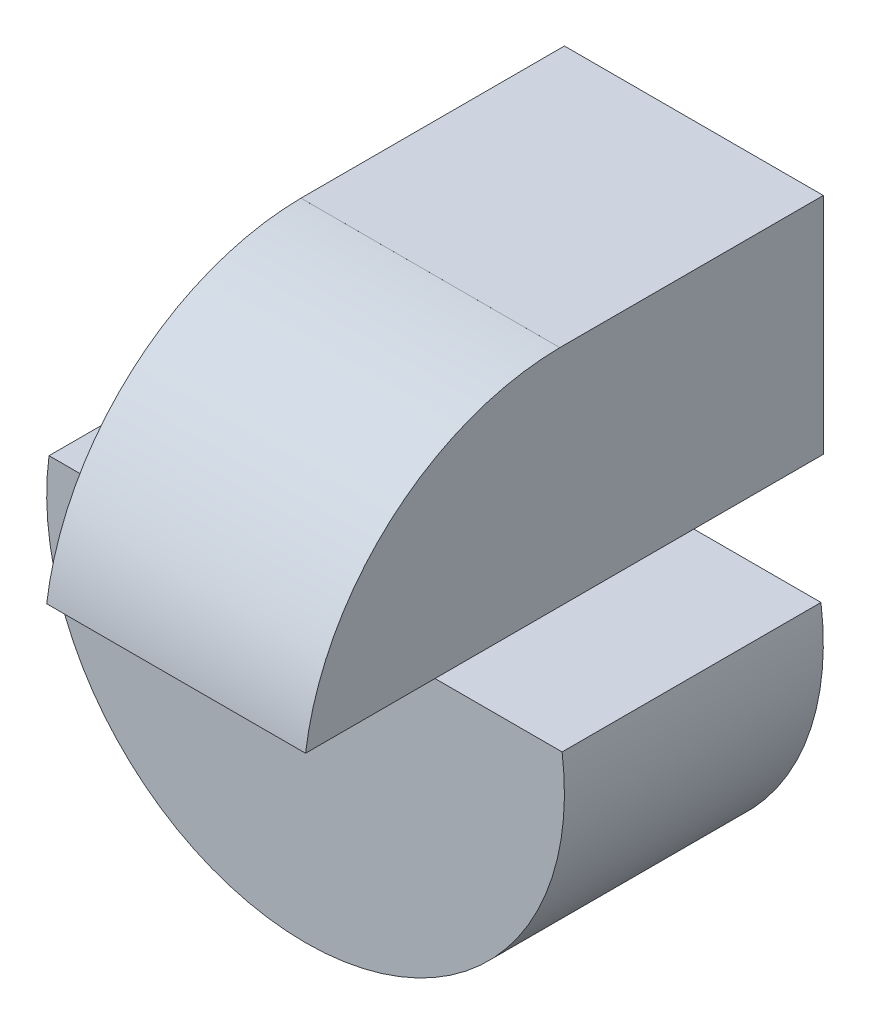
ISO-10303-21;
HEADER;
FILE_DESCRIPTION(('STEP AP214'),'2;1');
FILE_NAME('part.step','',(''),(''),'','','');
FILE_SCHEMA(('AUTOMOTIVE_DESIGN { 1 0 10303 214 1 1 1 1 }'));
ENDSEC;
DATA;
#1=APPLICATION_CONTEXT('core data for automotive mechanical design processes');
#2=APPLICATION_PROTOCOL_DEFINITION('international standard','automotive_design',2000,#1);
#3=PRODUCT_CONTEXT('',#1,'mechanical');
#4=PRODUCT('Part','Part','',(#3));
#5=PRODUCT_RELATED_PRODUCT_CATEGORY('part','',(#4));
#6=PRODUCT_DEFINITION_FORMATION('','',#4);
#7=PRODUCT_DEFINITION_CONTEXT('part definition',#1,'design');
#8=PRODUCT_DEFINITION('design','',#6,#7);
#9=PRODUCT_DEFINITION_SHAPE('','',#8);
#10=(LENGTH_UNIT() NAMED_UNIT(*) SI_UNIT(.MILLI.,.METRE.));
#11=(NAMED_UNIT(*) PLANE_ANGLE_UNIT() SI_UNIT($,.RADIAN.));
#12=(NAMED_UNIT(*) SI_UNIT($,.STERADIAN.) SOLID_ANGLE_UNIT());
#13=UNCERTAINTY_MEASURE_WITH_UNIT(LENGTH_MEASURE(1.E-05),#10,'distance_accuracy_value','');
#14=(GEOMETRIC_REPRESENTATION_CONTEXT(3) GLOBAL_UNCERTAINTY_ASSIGNED_CONTEXT((#13)) GLOBAL_UNIT_ASSIGNED_CONTEXT((#10,
#11,#12)) REPRESENTATION_CONTEXT('',''));
#15=CARTESIAN_POINT('',(0.,0.,0.));
#16=DIRECTION('',(0.,0.,1.));
#17=DIRECTION('',(1.,0.,0.));
#18=AXIS2_PLACEMENT_3D('',#15,#16,#17);
#19=CARTESIAN_POINT('',(30.,0.,0.));
#20=DIRECTION('',(-1.,0.,0.));
#21=DIRECTION('',(0.,0.,1.));
#22=AXIS2_PLACEMENT_3D('',#19,#20,#21);
#23=PLANE('',#22);
#24=DIRECTION('',(0.,0.,-1.));
#25=VECTOR('',#24,1.);
#26=CARTESIAN_POINT('',(30.,22.6794919243112,0.));
#27=LINE('',#26,#25);
#28=CARTESIAN_POINT('',(30.,22.6794919243112,40.));
#29=VERTEX_POINT('',#28);
#30=CARTESIAN_POINT('',(30.,22.6794919243112,30.));
#31=VERTEX_POINT('',#30);
#32=EDGE_CURVE('E246',#29,#31,#27,.T.);
#33=ORIENTED_EDGE('',*,*,#32,.T.);
#34=DIRECTION('',(0.,0.,-1.));
#35=VECTOR('',#34,1.);
#36=CARTESIAN_POINT('',(30.,22.6794919243112,0.));
#37=LINE('',#36,#35);
#38=CARTESIAN_POINT('',(30.,22.6794919243112,10.));
#39=VERTEX_POINT('',#38);
#40=EDGE_CURVE('E220',#31,#39,#37,.T.);
#41=ORIENTED_EDGE('',*,*,#40,.T.);
#42=DIRECTION('',(0.,0.,1.));
#43=VECTOR('',#42,1.);
#44=CARTESIAN_POINT('',(30.,22.6794919243112,0.));
#45=LINE('',#44,#43);
#46=CARTESIAN_POINT('',(30.,22.6794919243112,0.));
#47=VERTEX_POINT('',#46);
#48=EDGE_CURVE('E257',#47,#39,#45,.T.);
#49=ORIENTED_EDGE('',*,*,#48,.F.);
#50=DIRECTION('',(0.,-1.,0.));
#51=VECTOR('',#50,1.);
#52=CARTESIAN_POINT('',(30.,0.,0.));
#53=LINE('',#52,#51);
#54=CARTESIAN_POINT('',(30.,40.,0.));
#55=VERTEX_POINT('',#54);
#56=EDGE_CURVE('E122',#55,#47,#53,.T.);
#57=ORIENTED_EDGE('',*,*,#56,.F.);
#58=DIRECTION('',(0.,0.,1.));
#59=VECTOR('',#58,1.);
#60=CARTESIAN_POINT('',(30.,40.,0.));
#61=LINE('',#60,#59);
#62=CARTESIAN_POINT('',(30.,40.,20.3589838648405));
#63=VERTEX_POINT('',#62);
#64=EDGE_CURVE('E265',#55,#63,#61,.T.);
#65=ORIENTED_EDGE('',*,*,#64,.T.);
#66=DIRECTION('',(0.,-0.999999999174274,4.06380500238847E-05));
#67=VECTOR('',#66,1.);
#68=CARTESIAN_POINT('',(30.,79.9992017943754,20.3573583752758));
#69=LINE('',#68,#67);
#70=CARTESIAN_POINT('',(30.,39.9992018274044,20.3589838972767));
#71=VERTEX_POINT('',#70);
#72=EDGE_CURVE('E223',#63,#71,#69,.T.);
#73=ORIENTED_EDGE('',*,*,#72,.T.);
#74=CARTESIAN_POINT('',(30.,20.,20.1803046686497));
#75=DIRECTION('',(-1.,0.,0.));
#76=DIRECTION('',(0.,0.,1.));
#77=AXIS2_PLACEMENT_3D('',#74,#75,#76);
#78=CIRCLE('',#77,20.);
#79=EDGE_CURVE('E234',#29,#71,#78,.T.);
#80=ORIENTED_EDGE('',*,*,#79,.F.);
#81=EDGE_LOOP('',(#33,#41,#49,#57,#65,#73,#80));
#82=FACE_BOUND('',#81,.T.);
#83=ADVANCED_FACE('F114',(#82),#23,.F.);
#84=CARTESIAN_POINT('',(10.,0.,0.));
#85=DIRECTION('',(-1.,0.,0.));
#86=DIRECTION('',(0.,-1.,0.));
#87=AXIS2_PLACEMENT_3D('',#84,#85,#86);
#88=PLANE('',#87);
#89=DIRECTION('',(0.,0.,-1.));
#90=VECTOR('',#89,1.);
#91=CARTESIAN_POINT('',(10.,22.6794919243112,0.));
#92=LINE('',#91,#90);
#93=CARTESIAN_POINT('',(10.,22.6794919243112,30.));
#94=VERTEX_POINT('',#93);
#95=CARTESIAN_POINT('',(10.,22.6794919243112,10.));
#96=VERTEX_POINT('',#95);
#97=EDGE_CURVE('E217',#94,#96,#92,.T.);
#98=ORIENTED_EDGE('',*,*,#97,.F.);
#99=DIRECTION('',(0.,0.,-1.));
#100=VECTOR('',#99,1.);
#101=CARTESIAN_POINT('',(10.,22.6794919243112,0.));
#102=LINE('',#101,#100);
#103=CARTESIAN_POINT('',(10.,22.6794919243112,40.));
#104=VERTEX_POINT('',#103);
#105=EDGE_CURVE('E239',#104,#94,#102,.T.);
#106=ORIENTED_EDGE('',*,*,#105,.F.);
#107=CARTESIAN_POINT('',(10.,20.,20.1803046686497));
#108=DIRECTION('',(-1.,0.,0.));
#109=DIRECTION('',(0.,-1.,0.));
#110=AXIS2_PLACEMENT_3D('',#107,#108,#109);
#111=CIRCLE('',#110,20.);
#112=CARTESIAN_POINT('',(10.,39.9992018274044,20.3589838972767));
#113=VERTEX_POINT('',#112);
#114=EDGE_CURVE('E230',#104,#113,#111,.T.);
#115=ORIENTED_EDGE('',*,*,#114,.T.);
#116=DIRECTION('',(0.,-0.999999999174274,4.06380500238847E-05));
#117=VECTOR('',#116,1.);
#118=CARTESIAN_POINT('',(10.,79.9992017943754,20.3573583752758));
#119=LINE('',#118,#117);
#120=CARTESIAN_POINT('',(10.,40.,20.3589838648405));
#121=VERTEX_POINT('',#120);
#122=EDGE_CURVE('E222',#121,#113,#119,.T.);
#123=ORIENTED_EDGE('',*,*,#122,.F.);
#124=DIRECTION('',(0.,0.,1.));
#125=VECTOR('',#124,1.);
#126=CARTESIAN_POINT('',(10.,40.,0.));
#127=LINE('',#126,#125);
#128=CARTESIAN_POINT('',(10.,40.,0.));
#129=VERTEX_POINT('',#128);
#130=EDGE_CURVE('E136',#129,#121,#127,.T.);
#131=ORIENTED_EDGE('',*,*,#130,.F.);
#132=DIRECTION('',(0.,-1.,0.));
#133=VECTOR('',#132,1.);
#134=CARTESIAN_POINT('',(10.,0.,0.));
#135=LINE('',#134,#133);
#136=CARTESIAN_POINT('',(10.,22.6794919243112,0.));
#137=VERTEX_POINT('',#136);
#138=EDGE_CURVE('E263',#129,#137,#135,.T.);
#139=ORIENTED_EDGE('',*,*,#138,.T.);
#140=DIRECTION('',(0.,0.,1.));
#141=VECTOR('',#140,1.);
#142=CARTESIAN_POINT('',(10.,22.6794919243112,0.));
#143=LINE('',#142,#141);
#144=EDGE_CURVE('E251',#137,#96,#143,.T.);
#145=ORIENTED_EDGE('',*,*,#144,.T.);
#146=EDGE_LOOP('',(#98,#106,#115,#123,#131,#139,#145));
#147=FACE_BOUND('',#146,.T.);
#148=ADVANCED_FACE('F280',(#147),#88,.T.);
#149=CARTESIAN_POINT('',(0.,0.,0.));
#150=DIRECTION('',(0.,0.,-1.));
#151=DIRECTION('',(-1.,0.,0.));
#152=AXIS2_PLACEMENT_3D('',#149,#150,#151);
#153=PLANE('',#152);
#154=ORIENTED_EDGE('',*,*,#56,.T.);
#155=DIRECTION('',(-1.,0.,0.));
#156=VECTOR('',#155,1.);
#157=CARTESIAN_POINT('',(50.,22.6794919243112,0.));
#158=LINE('',#157,#156);
#159=EDGE_CURVE('E254',#47,#137,#158,.T.);
#160=ORIENTED_EDGE('',*,*,#159,.T.);
#161=ORIENTED_EDGE('',*,*,#138,.F.);
#162=DIRECTION('',(-1.,0.,0.));
#163=VECTOR('',#162,1.);
#164=CARTESIAN_POINT('',(0.,40.,0.));
#165=LINE('',#164,#163);
#166=EDGE_CURVE('E12',#55,#129,#165,.T.);
#167=ORIENTED_EDGE('',*,*,#166,.F.);
#168=EDGE_LOOP('',(#154,#160,#161,#167));
#169=FACE_BOUND('',#168,.T.);
#170=ADVANCED_FACE('F268',(#169),#153,.T.);
#171=CARTESIAN_POINT('',(0.,40.,40.));
#172=DIRECTION('',(0.,-1.,0.));
#173=DIRECTION('',(0.,0.,-1.));
#174=AXIS2_PLACEMENT_3D('',#171,#172,#173);
#175=PLANE('',#174);
#176=ORIENTED_EDGE('',*,*,#130,.T.);
#177=DIRECTION('',(1.,0.,0.));
#178=VECTOR('',#177,1.);
#179=CARTESIAN_POINT('',(0.,40.,20.3589838648405));
#180=LINE('',#179,#178);
#181=EDGE_CURVE('E226',#121,#63,#180,.T.);
#182=ORIENTED_EDGE('',*,*,#181,.T.);
#183=ORIENTED_EDGE('',*,*,#64,.F.);
#184=ORIENTED_EDGE('',*,*,#166,.T.);
#185=EDGE_LOOP('',(#176,#182,#183,#184));
#186=FACE_BOUND('',#185,.T.);
#187=ADVANCED_FACE('F116',(#186),#175,.F.);
#188=CARTESIAN_POINT('',(20.,20.,0.));
#189=DIRECTION('',(0.,0.,1.));
#190=DIRECTION('',(1.,0.,0.));
#191=AXIS2_PLACEMENT_3D('',#188,#189,#190);
#192=CYLINDRICAL_SURFACE('',#191,20.);
#193=CARTESIAN_POINT('',(20.,20.,30.));
#194=DIRECTION('',(0.,0.,-1.));
#195=DIRECTION('',(-1.,0.,0.));
#196=AXIS2_PLACEMENT_3D('',#193,#194,#195);
#197=CIRCLE('',#196,20.);
#198=CARTESIAN_POINT('',(39.8196953313504,22.6794919243112,30.));
#199=VERTEX_POINT('',#198);
#200=CARTESIAN_POINT('',(0.180304668649656,22.6794919243112,30.));
#201=VERTEX_POINT('',#200);
#202=EDGE_CURVE('E199',#199,#201,#197,.T.);
#203=ORIENTED_EDGE('',*,*,#202,.T.);
#204=DIRECTION('',(0.,0.,1.));
#205=VECTOR('',#204,1.);
#206=CARTESIAN_POINT('',(0.180304668649656,22.6794919243112,10.));
#207=LINE('',#206,#205);
#208=CARTESIAN_POINT('',(0.180304668649656,22.6794919243112,10.));
#209=VERTEX_POINT('',#208);
#210=EDGE_CURVE('E194',#209,#201,#207,.T.);
#211=ORIENTED_EDGE('',*,*,#210,.F.);
#212=CARTESIAN_POINT('',(20.,20.,10.));
#213=DIRECTION('',(0.,0.,1.));
#214=DIRECTION('',(1.,0.,0.));
#215=AXIS2_PLACEMENT_3D('',#212,#213,#214);
#216=CIRCLE('',#215,20.);
#217=CARTESIAN_POINT('',(39.8196953313504,22.6794919243112,10.));
#218=VERTEX_POINT('',#217);
#219=EDGE_CURVE('E188',#209,#218,#216,.T.);
#220=ORIENTED_EDGE('',*,*,#219,.T.);
#221=DIRECTION('',(0.,0.,1.));
#222=VECTOR('',#221,1.);
#223=CARTESIAN_POINT('',(39.8196953313504,22.6794919243112,10.));
#224=LINE('',#223,#222);
#225=EDGE_CURVE('E191',#218,#199,#224,.T.);
#226=ORIENTED_EDGE('',*,*,#225,.T.);
#227=EDGE_LOOP('',(#203,#211,#220,#226));
#228=FACE_BOUND('',#227,.T.);
#229=ADVANCED_FACE('F190',(#228),#192,.T.);
#230=CARTESIAN_POINT('',(0.,-20.,10.));
#231=DIRECTION('',(0.,0.,1.));
#232=DIRECTION('',(1.,0.,0.));
#233=AXIS2_PLACEMENT_3D('',#230,#231,#232);
#234=PLANE('',#233);
#235=ORIENTED_EDGE('',*,*,#219,.F.);
#236=DIRECTION('',(-1.,0.,0.));
#237=VECTOR('',#236,1.);
#238=CARTESIAN_POINT('',(0.180304668649656,22.6794919243112,10.));
#239=LINE('',#238,#237);
#240=EDGE_CURVE('E212',#96,#209,#239,.T.);
#241=ORIENTED_EDGE('',*,*,#240,.F.);
#242=DIRECTION('',(-1.,0.,0.));
#243=VECTOR('',#242,1.);
#244=CARTESIAN_POINT('',(50.,22.6794919243112,10.));
#245=LINE('',#244,#243);
#246=EDGE_CURVE('E211',#39,#96,#245,.T.);
#247=ORIENTED_EDGE('',*,*,#246,.F.);
#248=EDGE_CURVE('E203',#218,#39,#239,.T.);
#249=ORIENTED_EDGE('',*,*,#248,.F.);
#250=EDGE_LOOP('',(#235,#241,#247,#249));
#251=FACE_BOUND('',#250,.T.);
#252=ADVANCED_FACE('F209',(#251),#234,.F.);
#253=CARTESIAN_POINT('',(40.,-20.,30.));
#254=DIRECTION('',(0.,0.,-1.));
#255=DIRECTION('',(-1.,0.,0.));
#256=AXIS2_PLACEMENT_3D('',#253,#254,#255);
#257=PLANE('',#256);
#258=ORIENTED_EDGE('',*,*,#202,.F.);
#259=DIRECTION('',(-1.,0.,0.));
#260=VECTOR('',#259,1.);
#261=CARTESIAN_POINT('',(0.180304668649656,22.6794919243112,30.));
#262=LINE('',#261,#260);
#263=EDGE_CURVE('E206',#199,#31,#262,.T.);
#264=ORIENTED_EDGE('',*,*,#263,.T.);
#265=DIRECTION('',(-1.,0.,0.));
#266=VECTOR('',#265,1.);
#267=CARTESIAN_POINT('',(50.,22.6794919243112,30.));
#268=LINE('',#267,#266);
#269=EDGE_CURVE('E242',#31,#94,#268,.T.);
#270=ORIENTED_EDGE('',*,*,#269,.T.);
#271=EDGE_CURVE('E216',#94,#201,#262,.T.);
#272=ORIENTED_EDGE('',*,*,#271,.T.);
#273=EDGE_LOOP('',(#258,#264,#270,#272));
#274=FACE_BOUND('',#273,.T.);
#275=ADVANCED_FACE('F284',(#274),#257,.F.);
#276=CARTESIAN_POINT('',(50.,22.6794919243112,0.));
#277=DIRECTION('',(0.,-1.,0.));
#278=DIRECTION('',(1.,0.,0.));
#279=AXIS2_PLACEMENT_3D('',#276,#277,#278);
#280=PLANE('',#279);
#281=ORIENTED_EDGE('',*,*,#48,.T.);
#282=ORIENTED_EDGE('',*,*,#246,.T.);
#283=ORIENTED_EDGE('',*,*,#144,.F.);
#284=ORIENTED_EDGE('',*,*,#159,.F.);
#285=EDGE_LOOP('',(#281,#282,#283,#284));
#286=FACE_BOUND('',#285,.T.);
#287=ADVANCED_FACE('F286',(#286),#280,.T.);
#288=CARTESIAN_POINT('',(50.,22.6794919243112,0.));
#289=DIRECTION('',(0.,1.,0.));
#290=DIRECTION('',(-1.,0.,0.));
#291=AXIS2_PLACEMENT_3D('',#288,#289,#290);
#292=PLANE('',#291);
#293=DIRECTION('',(-1.,0.,0.));
#294=VECTOR('',#293,1.);
#295=CARTESIAN_POINT('',(50.,22.6794919243112,40.));
#296=LINE('',#295,#294);
#297=EDGE_CURVE('E243',#29,#104,#296,.T.);
#298=ORIENTED_EDGE('',*,*,#297,.T.);
#299=ORIENTED_EDGE('',*,*,#105,.T.);
#300=ORIENTED_EDGE('',*,*,#269,.F.);
#301=ORIENTED_EDGE('',*,*,#32,.F.);
#302=EDGE_LOOP('',(#298,#299,#300,#301));
#303=FACE_BOUND('',#302,.T.);
#304=ADVANCED_FACE('F277',(#303),#292,.F.);
#305=CARTESIAN_POINT('',(50.,20.,20.1803046686497));
#306=DIRECTION('',(-1.,0.,0.));
#307=DIRECTION('',(0.,-1.,0.));
#308=AXIS2_PLACEMENT_3D('',#305,#306,#307);
#309=CYLINDRICAL_SURFACE('',#308,20.);
#310=ORIENTED_EDGE('',*,*,#79,.T.);
#311=DIRECTION('',(-1.,0.,0.));
#312=VECTOR('',#311,1.);
#313=CARTESIAN_POINT('',(50.,39.9992018274044,20.3589838972767));
#314=LINE('',#313,#312);
#315=EDGE_CURVE('E231',#71,#113,#314,.T.);
#316=ORIENTED_EDGE('',*,*,#315,.T.);
#317=ORIENTED_EDGE('',*,*,#114,.F.);
#318=ORIENTED_EDGE('',*,*,#297,.F.);
#319=EDGE_LOOP('',(#310,#316,#317,#318));
#320=FACE_BOUND('',#319,.T.);
#321=ADVANCED_FACE('F274',(#320),#309,.T.);
#322=CARTESIAN_POINT('',(30.,79.9992017943754,20.3573583752758));
#323=DIRECTION('',(0.,-4.06380500238847E-05,-0.999999999174274));
#324=DIRECTION('',(0.,0.999999999174275,-4.06380500238847E-05));
#325=AXIS2_PLACEMENT_3D('',#322,#323,#324);
#326=PLANE('',#325);
#327=ORIENTED_EDGE('',*,*,#122,.T.);
#328=ORIENTED_EDGE('',*,*,#315,.F.);
#329=ORIENTED_EDGE('',*,*,#72,.F.);
#330=ORIENTED_EDGE('',*,*,#181,.F.);
#331=EDGE_LOOP('',(#327,#328,#329,#330));
#332=FACE_BOUND('',#331,.T.);
#333=ADVANCED_FACE('F349',(#332),#326,.F.);
#334=CARTESIAN_POINT('',(0.180304668649656,22.6794919243112,10.));
#335=DIRECTION('',(0.,1.,0.));
#336=DIRECTION('',(-1.,0.,0.));
#337=AXIS2_PLACEMENT_3D('',#334,#335,#336);
#338=PLANE('',#337);
#339=ORIENTED_EDGE('',*,*,#271,.F.);
#340=ORIENTED_EDGE('',*,*,#97,.T.);
#341=ORIENTED_EDGE('',*,*,#240,.T.);
#342=ORIENTED_EDGE('',*,*,#210,.T.);
#343=EDGE_LOOP('',(#339,#340,#341,#342));
#344=FACE_BOUND('',#343,.T.);
#345=ADVANCED_FACE('F345',(#344),#338,.T.);
#346=ORIENTED_EDGE('',*,*,#40,.F.);
#347=ORIENTED_EDGE('',*,*,#263,.F.);
#348=ORIENTED_EDGE('',*,*,#225,.F.);
#349=ORIENTED_EDGE('',*,*,#248,.T.);
#350=EDGE_LOOP('',(#346,#347,#348,#349));
#351=FACE_BOUND('',#350,.T.);
#352=ADVANCED_FACE('F202',(#351),#338,.T.);
#353=CLOSED_SHELL('',(#83,#148,#170,#187,#229,#252,#275,#287,#304,#321,#333,#345,#352));
#354=MANIFOLD_SOLID_BREP('B2',#353);
#355=ADVANCED_BREP_SHAPE_REPRESENTATION('',(#18,#354),#14);
#356=SHAPE_DEFINITION_REPRESENTATION(#9,#355);
ENDSEC;
END-ISO-10303-21;
